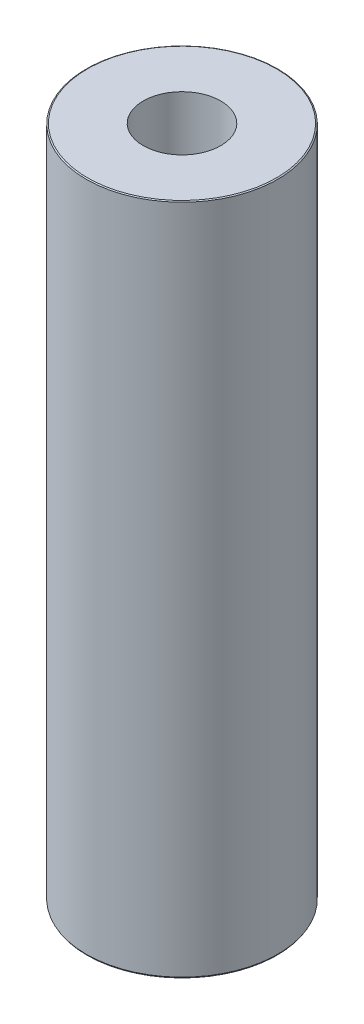
ISO-10303-21;
HEADER;
FILE_DESCRIPTION(('STEP AP214'),'2;1');
FILE_NAME('part.step','',(''),(''),'','','');
FILE_SCHEMA(('AUTOMOTIVE_DESIGN { 1 0 10303 214 1 1 1 1 }'));
ENDSEC;
DATA;
#1=APPLICATION_CONTEXT('core data for automotive mechanical design processes');
#2=APPLICATION_PROTOCOL_DEFINITION('international standard','automotive_design',2000,#1);
#3=PRODUCT_CONTEXT('',#1,'mechanical');
#4=PRODUCT('Part','Part','',(#3));
#5=PRODUCT_RELATED_PRODUCT_CATEGORY('part','',(#4));
#6=PRODUCT_DEFINITION_FORMATION('','',#4);
#7=PRODUCT_DEFINITION_CONTEXT('part definition',#1,'design');
#8=PRODUCT_DEFINITION('design','',#6,#7);
#9=PRODUCT_DEFINITION_SHAPE('','',#8);
#10=(LENGTH_UNIT() NAMED_UNIT(*) SI_UNIT(.MILLI.,.METRE.));
#11=(NAMED_UNIT(*) PLANE_ANGLE_UNIT() SI_UNIT($,.RADIAN.));
#12=(NAMED_UNIT(*) SI_UNIT($,.STERADIAN.) SOLID_ANGLE_UNIT());
#13=UNCERTAINTY_MEASURE_WITH_UNIT(LENGTH_MEASURE(1.E-05),#10,'distance_accuracy_value','');
#14=(GEOMETRIC_REPRESENTATION_CONTEXT(3) GLOBAL_UNCERTAINTY_ASSIGNED_CONTEXT((#13)) GLOBAL_UNIT_ASSIGNED_CONTEXT((#10,
#11,#12)) REPRESENTATION_CONTEXT('',''));
#15=CARTESIAN_POINT('',(0.,0.,0.));
#16=DIRECTION('',(0.,0.,1.));
#17=DIRECTION('',(1.,0.,0.));
#18=AXIS2_PLACEMENT_3D('',#15,#16,#17);
#19=CARTESIAN_POINT('',(0.,421.984386097668,0.));
#20=DIRECTION('',(0.,-1.,0.));
#21=DIRECTION('',(0.,0.,-1.));
#22=AXIS2_PLACEMENT_3D('',#19,#20,#21);
#23=CYLINDRICAL_SURFACE('',#22,60.);
#24=CARTESIAN_POINT('',(0.,421.550899514023,0.));
#25=DIRECTION('',(0.,1.,0.));
#26=DIRECTION('',(0.,0.,1.));
#27=AXIS2_PLACEMENT_3D('',#24,#25,#26);
#28=CIRCLE('',#27,60.);
#29=CARTESIAN_POINT('',(0.,421.550899514023,-60.));
#30=VERTEX_POINT('',#29);
#31=EDGE_CURVE('E50',#30,#30,#28,.F.);
#32=ORIENTED_EDGE('',*,*,#31,.T.);
#33=EDGE_LOOP('',(#32));
#34=FACE_BOUND('',#33,.T.);
#35=CARTESIAN_POINT('',(0.,0.750820787272899,0.));
#36=DIRECTION('',(0.,1.,0.));
#37=DIRECTION('',(0.,0.,1.));
#38=AXIS2_PLACEMENT_3D('',#35,#36,#37);
#39=CIRCLE('',#38,60.);
#40=CARTESIAN_POINT('',(0.,0.750820787272899,60.));
#41=VERTEX_POINT('',#40);
#42=EDGE_CURVE('E51',#41,#41,#39,.T.);
#43=ORIENTED_EDGE('',*,*,#42,.T.);
#44=EDGE_LOOP('',(#43));
#45=FACE_BOUND('',#44,.T.);
#46=ADVANCED_FACE('F39',(#34,#45),#23,.T.);
#47=CARTESIAN_POINT('',(0.,421.984386097668,0.));
#48=DIRECTION('',(0.,1.,0.));
#49=DIRECTION('',(0.,0.,1.));
#50=AXIS2_PLACEMENT_3D('',#47,#48,#49);
#51=PLANE('',#50);
#52=CARTESIAN_POINT('',(0.,421.984386097668,0.));
#53=DIRECTION('',(0.,1.,0.));
#54=DIRECTION('',(0.,0.,1.));
#55=AXIS2_PLACEMENT_3D('',#52,#53,#54);
#56=CIRCLE('',#55,59.249179212727);
#57=CARTESIAN_POINT('',(0.,421.984386097668,-59.249179212727));
#58=VERTEX_POINT('',#57);
#59=EDGE_CURVE('E54',#58,#58,#56,.T.);
#60=ORIENTED_EDGE('',*,*,#59,.T.);
#61=EDGE_LOOP('',(#60));
#62=FACE_BOUND('',#61,.T.);
#63=CARTESIAN_POINT('',(0.,421.984386097668,0.));
#64=DIRECTION('',(0.,1.,0.));
#65=DIRECTION('',(0.,0.,1.));
#66=AXIS2_PLACEMENT_3D('',#63,#64,#65);
#67=CIRCLE('',#66,24.3065687049267);
#68=CARTESIAN_POINT('',(0.,421.984386097668,24.3065687049267));
#69=VERTEX_POINT('',#68);
#70=EDGE_CURVE('E58',#69,#69,#67,.T.);
#71=ORIENTED_EDGE('',*,*,#70,.F.);
#72=EDGE_LOOP('',(#71));
#73=FACE_BOUND('',#72,.T.);
#74=ADVANCED_FACE('F69',(#62,#73),#51,.T.);
#75=CARTESIAN_POINT('',(0.,0.,0.));
#76=DIRECTION('',(0.,1.,0.));
#77=DIRECTION('',(0.,0.,1.));
#78=AXIS2_PLACEMENT_3D('',#75,#76,#77);
#79=PLANE('',#78);
#80=CARTESIAN_POINT('',(0.,0.,0.));
#81=DIRECTION('',(0.,1.,0.));
#82=DIRECTION('',(0.,0.,1.));
#83=AXIS2_PLACEMENT_3D('',#80,#81,#82);
#84=CIRCLE('',#83,59.5665134163548);
#85=CARTESIAN_POINT('',(0.,0.,59.5665134163548));
#86=VERTEX_POINT('',#85);
#87=EDGE_CURVE('E10',#86,#86,#84,.F.);
#88=ORIENTED_EDGE('',*,*,#87,.T.);
#89=EDGE_LOOP('',(#88));
#90=FACE_BOUND('',#89,.T.);
#91=CARTESIAN_POINT('',(0.,0.,0.));
#92=DIRECTION('',(0.,1.,0.));
#93=DIRECTION('',(0.,0.,1.));
#94=AXIS2_PLACEMENT_3D('',#91,#92,#93);
#95=CIRCLE('',#94,24.3065687049267);
#96=CARTESIAN_POINT('',(0.,0.,24.3065687049267));
#97=VERTEX_POINT('',#96);
#98=EDGE_CURVE('E63',#97,#97,#95,.T.);
#99=ORIENTED_EDGE('',*,*,#98,.T.);
#100=EDGE_LOOP('',(#99));
#101=FACE_BOUND('',#100,.T.);
#102=ADVANCED_FACE('F75',(#90,#101),#79,.F.);
#103=CARTESIAN_POINT('',(0.,421.984386097668,0.));
#104=DIRECTION('',(0.,-1.,0.));
#105=DIRECTION('',(0.,0.,-1.));
#106=AXIS2_PLACEMENT_3D('',#103,#104,#105);
#107=CYLINDRICAL_SURFACE('',#106,24.3065687049267);
#108=ORIENTED_EDGE('',*,*,#70,.T.);
#109=EDGE_LOOP('',(#108));
#110=FACE_BOUND('',#109,.T.);
#111=ORIENTED_EDGE('',*,*,#98,.F.);
#112=EDGE_LOOP('',(#111));
#113=FACE_BOUND('',#112,.T.);
#114=ADVANCED_FACE('F70',(#110,#113),#107,.F.);
#115=CARTESIAN_POINT('',(0.,421.984386097668,0.));
#116=DIRECTION('',(0.,-1.,0.));
#117=DIRECTION('',(0.,0.,-1.));
#118=AXIS2_PLACEMENT_3D('',#115,#116,#117);
#119=CONICAL_SURFACE('',#118,59.249179212727,1.04719755119661);
#120=CARTESIAN_POINT('',(0.,421.550899514023,-60.));
#121=CARTESIAN_POINT('',(0.,421.555414999269,-59.9921789501326));
#122=CARTESIAN_POINT('',(0.,421.559930484515,-59.9843579002652));
#123=CARTESIAN_POINT('',(0.,421.568961455008,-59.9687158005303));
#124=CARTESIAN_POINT('',(0.,421.573476940254,-59.9608947506629));
#125=CARTESIAN_POINT('',(0.,421.582507910747,-59.9452526509281));
#126=CARTESIAN_POINT('',(0.,421.587023395993,-59.9374316010606));
#127=CARTESIAN_POINT('',(0.,421.596054366486,-59.9217895013258));
#128=CARTESIAN_POINT('',(0.,421.600569851732,-59.9139684514583));
#129=CARTESIAN_POINT('',(0.,421.609600822225,-59.8983263517235));
#130=CARTESIAN_POINT('',(0.,421.614116307471,-59.8905053018561));
#131=CARTESIAN_POINT('',(0.,421.623147277964,-59.8748632021212));
#132=CARTESIAN_POINT('',(0.,421.62766276321,-59.8670421522538));
#133=CARTESIAN_POINT('',(0.,421.636693733702,-59.8514000525189));
#134=CARTESIAN_POINT('',(0.,421.641209218949,-59.8435790026515));
#135=CARTESIAN_POINT('',(0.,421.650240189441,-59.8279369029166));
#136=CARTESIAN_POINT('',(0.,421.654755674688,-59.8201158530492));
#137=CARTESIAN_POINT('',(0.,421.66378664518,-59.8044737533144));
#138=CARTESIAN_POINT('',(0.,421.668302130427,-59.7966527034469));
#139=CARTESIAN_POINT('',(0.,421.677333100919,-59.7810106037121));
#140=CARTESIAN_POINT('',(0.,421.681848586165,-59.7731895538447));
#141=CARTESIAN_POINT('',(0.,421.690879556658,-59.7575474541098));
#142=CARTESIAN_POINT('',(0.,421.695395041904,-59.7497264042424));
#143=CARTESIAN_POINT('',(0.,421.704426012397,-59.7340843045075));
#144=CARTESIAN_POINT('',(0.,421.708941497643,-59.7262632546401));
#145=CARTESIAN_POINT('',(0.,421.717972468136,-59.7106211549052));
#146=CARTESIAN_POINT('',(0.,421.722487953382,-59.7028001050378));
#147=CARTESIAN_POINT('',(0.,421.731518923875,-59.687158005303));
#148=CARTESIAN_POINT('',(0.,421.736034409121,-59.6793369554355));
#149=CARTESIAN_POINT('',(0.,421.745065379614,-59.6636948557007));
#150=CARTESIAN_POINT('',(0.,421.74958086486,-59.6558738058333));
#151=CARTESIAN_POINT('',(0.,421.758611835353,-59.6402317060984));
#152=CARTESIAN_POINT('',(0.,421.763127320599,-59.632410656231));
#153=CARTESIAN_POINT('',(0.,421.772158291092,-59.6167685564961));
#154=CARTESIAN_POINT('',(0.,421.776673776338,-59.6089475066287));
#155=CARTESIAN_POINT('',(0.,421.78570474683,-59.5933054068938));
#156=CARTESIAN_POINT('',(0.,421.790220232077,-59.5854843570264));
#157=CARTESIAN_POINT('',(0.,421.799251202569,-59.5698422572916));
#158=CARTESIAN_POINT('',(0.,421.803766687816,-59.5620212074241));
#159=CARTESIAN_POINT('',(0.,421.812797658308,-59.5463791076893));
#160=CARTESIAN_POINT('',(0.,421.817313143555,-59.5385580578218));
#161=CARTESIAN_POINT('',(0.,421.826344114047,-59.522915958087));
#162=CARTESIAN_POINT('',(0.,421.830859599293,-59.5150949082196));
#163=CARTESIAN_POINT('',(0.,421.839890569786,-59.4994528084847));
#164=CARTESIAN_POINT('',(0.,421.844406055032,-59.4916317586173));
#165=CARTESIAN_POINT('',(0.,421.853437025525,-59.4759896588824));
#166=CARTESIAN_POINT('',(0.,421.857952510771,-59.468168609015));
#167=CARTESIAN_POINT('',(0.,421.866983481264,-59.4525265092801));
#168=CARTESIAN_POINT('',(0.,421.87149896651,-59.4447054594127));
#169=CARTESIAN_POINT('',(0.,421.880529937003,-59.4290633596779));
#170=CARTESIAN_POINT('',(0.,421.885045422249,-59.4212423098104));
#171=CARTESIAN_POINT('',(0.,421.894076392742,-59.4056002100756));
#172=CARTESIAN_POINT('',(0.,421.898591877988,-59.3977791602082));
#173=CARTESIAN_POINT('',(0.,421.907622848481,-59.3821370604733));
#174=CARTESIAN_POINT('',(0.,421.912138333727,-59.3743160106059));
#175=CARTESIAN_POINT('',(0.,421.92116930422,-59.358673910871));
#176=CARTESIAN_POINT('',(0.,421.925684789466,-59.3508528610036));
#177=CARTESIAN_POINT('',(0.,421.934715759959,-59.3352107612687));
#178=CARTESIAN_POINT('',(0.,421.939231245205,-59.3273897114013));
#179=CARTESIAN_POINT('',(0.,421.948262215697,-59.3117476116665));
#180=CARTESIAN_POINT('',(0.,421.952777700944,-59.303926561799));
#181=CARTESIAN_POINT('',(0.,421.961808671436,-59.2882844620642));
#182=CARTESIAN_POINT('',(0.,421.966324156683,-59.2804634121968));
#183=CARTESIAN_POINT('',(0.,421.975355127175,-59.2648213124619));
#184=CARTESIAN_POINT('',(0.,421.979870612422,-59.2570002625945));
#185=CARTESIAN_POINT('',(0.,421.984386097668,-59.249179212727));
#186=B_SPLINE_CURVE_WITH_KNOTS('',3,(#120,#121,#122,#123,#124,#125,#126,#127,#128,#129,#130,
#131,#132,#133,#134,#135,#136,#137,#138,#139,#140,#141,#142,#143,#144,#145,#146,#147,#148,#149,
#150,#151,#152,#153,#154,#155,#156,#157,#158,#159,#160,#161,#162,#163,#164,#165,#166,#167,#168,
#169,#170,#171,#172,#173,#174,#175,#176,#177,#178,#179,#180,#181,#182,#183,#184,#185),
.UNSPECIFIED.,.F.,.F.,(4,2,2,2,2,2,2,2,2,2,2,2,2,2,2,2,2,2,2,2,2,2,2,2,2,2,2,2,2,2,2,2,4),(0.,
0.0270929114778053,0.0541858229556384,0.0812787344334655,0.108371645911299,0.135464557389132,
0.162557468866959,0.189650380344764,0.216743291822597,0.24383620330043,0.270929114778257,
0.29802202625609,0.325114937733923,0.352207849211723,0.379300760689556,0.406393672167389,
0.433486583645222,0.460579495123049,0.487672406600882,0.514765318078715,0.541858229556515,
0.568951141034348,0.596044052512181,0.623136963990014,0.650229875467841,0.677322786945674,
0.704415698423479,0.731508609901306,0.758601521379139,0.785694432856972,0.812787344334805,
0.839880255812632,0.866973167290465),.UNSPECIFIED.);
#187=EDGE_CURVE('BSEAM81',#30,#58,#186,.T.);
#188=ORIENTED_EDGE('',*,*,#31,.F.);
#189=ORIENTED_EDGE('',*,*,#59,.F.);
#190=ORIENTED_EDGE('',*,*,#187,.T.);
#191=ORIENTED_EDGE('',*,*,#187,.F.);
#192=EDGE_LOOP('',(#188,#190,#189,#191));
#193=FACE_BOUND('',#192,.T.);
#194=ADVANCED_FACE('F81',(#193),#119,.T.);
#195=CARTESIAN_POINT('',(0.,0.750820787272899,0.));
#196=DIRECTION('',(0.,1.,0.));
#197=DIRECTION('',(0.,0.,1.));
#198=AXIS2_PLACEMENT_3D('',#195,#196,#197);
#199=CONICAL_SURFACE('',#198,60.,0.523598775598322);
#200=ORIENTED_EDGE('',*,*,#87,.F.);
#201=EDGE_LOOP('',(#200));
#202=FACE_BOUND('',#201,.T.);
#203=ORIENTED_EDGE('',*,*,#42,.F.);
#204=EDGE_LOOP('',(#203));
#205=FACE_BOUND('',#204,.T.);
#206=ADVANCED_FACE('F45',(#202,#205),#199,.T.);
#207=CLOSED_SHELL('',(#46,#74,#102,#114,#194,#206));
#208=MANIFOLD_SOLID_BREP('B2',#207);
#209=ADVANCED_BREP_SHAPE_REPRESENTATION('',(#18,#208),#14);
#210=SHAPE_DEFINITION_REPRESENTATION(#9,#209);
ENDSEC;
END-ISO-10303-21;
